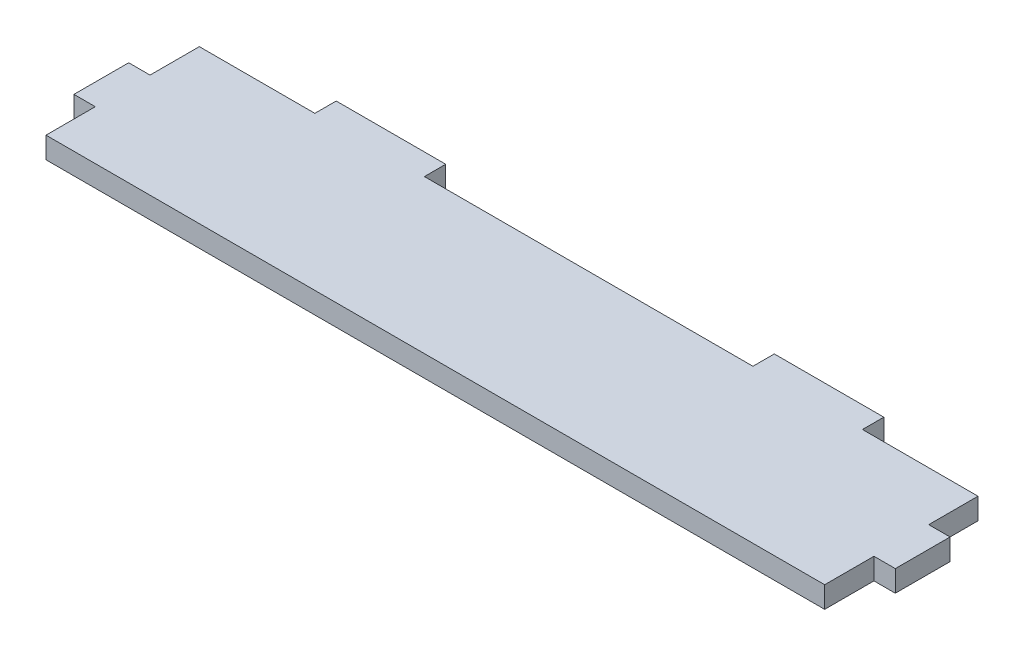
ISO-10303-21;
HEADER;
FILE_DESCRIPTION(('STEP AP214'),'2;1');
FILE_NAME('part.step','',(''),(''),'','','');
FILE_SCHEMA(('AUTOMOTIVE_DESIGN { 1 0 10303 214 1 1 1 1 }'));
ENDSEC;
DATA;
#1=APPLICATION_CONTEXT('core data for automotive mechanical design processes');
#2=APPLICATION_PROTOCOL_DEFINITION('international standard','automotive_design',2000,#1);
#3=PRODUCT_CONTEXT('',#1,'mechanical');
#4=PRODUCT('Part','Part','',(#3));
#5=PRODUCT_RELATED_PRODUCT_CATEGORY('part','',(#4));
#6=PRODUCT_DEFINITION_FORMATION('','',#4);
#7=PRODUCT_DEFINITION_CONTEXT('part definition',#1,'design');
#8=PRODUCT_DEFINITION('design','',#6,#7);
#9=PRODUCT_DEFINITION_SHAPE('','',#8);
#10=(LENGTH_UNIT() NAMED_UNIT(*) SI_UNIT(.MILLI.,.METRE.));
#11=(NAMED_UNIT(*) PLANE_ANGLE_UNIT() SI_UNIT($,.RADIAN.));
#12=(NAMED_UNIT(*) SI_UNIT($,.STERADIAN.) SOLID_ANGLE_UNIT());
#13=UNCERTAINTY_MEASURE_WITH_UNIT(LENGTH_MEASURE(1.E-05),#10,'distance_accuracy_value','');
#14=(GEOMETRIC_REPRESENTATION_CONTEXT(3) GLOBAL_UNCERTAINTY_ASSIGNED_CONTEXT((#13)) GLOBAL_UNIT_ASSIGNED_CONTEXT((#10,
#11,#12)) REPRESENTATION_CONTEXT('',''));
#15=CARTESIAN_POINT('',(0.,0.,0.));
#16=DIRECTION('',(0.,0.,1.));
#17=DIRECTION('',(1.,0.,0.));
#18=AXIS2_PLACEMENT_3D('',#15,#16,#17);
#19=CARTESIAN_POINT('',(71.1,3.9,4.99999999999998));
#20=DIRECTION('',(-1.,0.,0.));
#21=DIRECTION('',(0.,0.,1.));
#22=AXIS2_PLACEMENT_3D('',#19,#20,#21);
#23=PLANE('',#22);
#24=DIRECTION('',(0.,0.,-1.));
#25=VECTOR('',#24,1.);
#26=CARTESIAN_POINT('',(71.1,0.,4.99999999999998));
#27=LINE('',#26,#25);
#28=CARTESIAN_POINT('',(71.1,0.,14.));
#29=VERTEX_POINT('',#28);
#30=CARTESIAN_POINT('',(71.1,0.,4.99999999999998));
#31=VERTEX_POINT('',#30);
#32=EDGE_CURVE('E212',#29,#31,#27,.T.);
#33=ORIENTED_EDGE('',*,*,#32,.T.);
#34=DIRECTION('',(0.,-1.,0.));
#35=VECTOR('',#34,1.);
#36=CARTESIAN_POINT('',(71.1,3.9,4.99999999999998));
#37=LINE('',#36,#35);
#38=CARTESIAN_POINT('',(71.1,3.9,4.99999999999998));
#39=VERTEX_POINT('',#38);
#40=EDGE_CURVE('E11',#39,#31,#37,.T.);
#41=ORIENTED_EDGE('',*,*,#40,.F.);
#42=DIRECTION('',(0.,0.,-1.));
#43=VECTOR('',#42,1.);
#44=CARTESIAN_POINT('',(71.1,3.9,4.99999999999998));
#45=LINE('',#44,#43);
#46=CARTESIAN_POINT('',(71.1,3.9,14.));
#47=VERTEX_POINT('',#46);
#48=EDGE_CURVE('E270',#47,#39,#45,.T.);
#49=ORIENTED_EDGE('',*,*,#48,.F.);
#50=DIRECTION('',(0.,-1.,0.));
#51=VECTOR('',#50,1.);
#52=CARTESIAN_POINT('',(71.1,3.9,14.));
#53=LINE('',#52,#51);
#54=EDGE_CURVE('E208',#47,#29,#53,.T.);
#55=ORIENTED_EDGE('',*,*,#54,.T.);
#56=EDGE_LOOP('',(#33,#41,#49,#55));
#57=FACE_BOUND('',#56,.T.);
#58=ADVANCED_FACE('F39',(#57),#23,.F.);
#59=CARTESIAN_POINT('',(75.,3.9,4.99999999999998));
#60=DIRECTION('',(0.,0.,-1.));
#61=DIRECTION('',(-1.,0.,0.));
#62=AXIS2_PLACEMENT_3D('',#59,#60,#61);
#63=PLANE('',#62);
#64=DIRECTION('',(1.,0.,0.));
#65=VECTOR('',#64,1.);
#66=CARTESIAN_POINT('',(75.,0.,4.99999999999998));
#67=LINE('',#66,#65);
#68=CARTESIAN_POINT('',(75.,0.,4.99999999999998));
#69=VERTEX_POINT('',#68);
#70=EDGE_CURVE('E216',#31,#69,#67,.T.);
#71=ORIENTED_EDGE('',*,*,#70,.T.);
#72=DIRECTION('',(0.,-1.,0.));
#73=VECTOR('',#72,1.);
#74=CARTESIAN_POINT('',(75.,3.9,4.99999999999998));
#75=LINE('',#74,#73);
#76=CARTESIAN_POINT('',(75.,3.9,4.99999999999998));
#77=VERTEX_POINT('',#76);
#78=EDGE_CURVE('E48',#77,#69,#75,.T.);
#79=ORIENTED_EDGE('',*,*,#78,.F.);
#80=DIRECTION('',(1.,0.,0.));
#81=VECTOR('',#80,1.);
#82=CARTESIAN_POINT('',(75.,3.9,4.99999999999998));
#83=LINE('',#82,#81);
#84=EDGE_CURVE('E135',#39,#77,#83,.T.);
#85=ORIENTED_EDGE('',*,*,#84,.F.);
#86=ORIENTED_EDGE('',*,*,#40,.T.);
#87=EDGE_LOOP('',(#71,#79,#85,#86));
#88=FACE_BOUND('',#87,.T.);
#89=ADVANCED_FACE('F420',(#88),#63,.F.);
#90=CARTESIAN_POINT('',(75.,3.9,-5.00000000000002));
#91=DIRECTION('',(-1.,0.,0.));
#92=DIRECTION('',(0.,0.,1.));
#93=AXIS2_PLACEMENT_3D('',#90,#91,#92);
#94=PLANE('',#93);
#95=DIRECTION('',(0.,0.,-1.));
#96=VECTOR('',#95,1.);
#97=CARTESIAN_POINT('',(75.,0.,-5.00000000000002));
#98=LINE('',#97,#96);
#99=CARTESIAN_POINT('',(75.,0.,-5.00000000000002));
#100=VERTEX_POINT('',#99);
#101=EDGE_CURVE('E219',#69,#100,#98,.T.);
#102=ORIENTED_EDGE('',*,*,#101,.T.);
#103=DIRECTION('',(0.,-1.,0.));
#104=VECTOR('',#103,1.);
#105=CARTESIAN_POINT('',(75.,3.9,-5.00000000000002));
#106=LINE('',#105,#104);
#107=CARTESIAN_POINT('',(75.,3.9,-5.00000000000002));
#108=VERTEX_POINT('',#107);
#109=EDGE_CURVE('E329',#108,#100,#106,.T.);
#110=ORIENTED_EDGE('',*,*,#109,.F.);
#111=DIRECTION('',(0.,0.,-1.));
#112=VECTOR('',#111,1.);
#113=CARTESIAN_POINT('',(75.,3.9,-5.00000000000002));
#114=LINE('',#113,#112);
#115=EDGE_CURVE('E339',#77,#108,#114,.T.);
#116=ORIENTED_EDGE('',*,*,#115,.F.);
#117=ORIENTED_EDGE('',*,*,#78,.T.);
#118=EDGE_LOOP('',(#102,#110,#116,#117));
#119=FACE_BOUND('',#118,.T.);
#120=ADVANCED_FACE('F337',(#119),#94,.F.);
#121=CARTESIAN_POINT('',(75.,3.9,-5.00000000000002));
#122=DIRECTION('',(0.,0.,1.));
#123=DIRECTION('',(1.,0.,0.));
#124=AXIS2_PLACEMENT_3D('',#121,#122,#123);
#125=PLANE('',#124);
#126=DIRECTION('',(-1.,0.,0.));
#127=VECTOR('',#126,1.);
#128=CARTESIAN_POINT('',(75.,0.,-5.00000000000002));
#129=LINE('',#128,#127);
#130=CARTESIAN_POINT('',(71.1,0.,-5.00000000000002));
#131=VERTEX_POINT('',#130);
#132=EDGE_CURVE('E222',#100,#131,#129,.T.);
#133=ORIENTED_EDGE('',*,*,#132,.T.);
#134=DIRECTION('',(0.,-1.,0.));
#135=VECTOR('',#134,1.);
#136=CARTESIAN_POINT('',(71.1,3.9,-5.00000000000002));
#137=LINE('',#136,#135);
#138=CARTESIAN_POINT('',(71.1,3.9,-5.00000000000002));
#139=VERTEX_POINT('',#138);
#140=EDGE_CURVE('E325',#139,#131,#137,.T.);
#141=ORIENTED_EDGE('',*,*,#140,.F.);
#142=DIRECTION('',(-1.,0.,0.));
#143=VECTOR('',#142,1.);
#144=CARTESIAN_POINT('',(75.,3.9,-5.00000000000002));
#145=LINE('',#144,#143);
#146=EDGE_CURVE('E358',#108,#139,#145,.T.);
#147=ORIENTED_EDGE('',*,*,#146,.F.);
#148=ORIENTED_EDGE('',*,*,#109,.T.);
#149=EDGE_LOOP('',(#133,#141,#147,#148));
#150=FACE_BOUND('',#149,.T.);
#151=ADVANCED_FACE('F348',(#150),#125,.F.);
#152=CARTESIAN_POINT('',(71.1,3.9,-14.));
#153=DIRECTION('',(-1.,0.,0.));
#154=DIRECTION('',(0.,0.,1.));
#155=AXIS2_PLACEMENT_3D('',#152,#153,#154);
#156=PLANE('',#155);
#157=DIRECTION('',(0.,0.,-1.));
#158=VECTOR('',#157,1.);
#159=CARTESIAN_POINT('',(71.1,0.,-14.));
#160=LINE('',#159,#158);
#161=CARTESIAN_POINT('',(71.1,0.,-14.));
#162=VERTEX_POINT('',#161);
#163=EDGE_CURVE('E225',#131,#162,#160,.T.);
#164=ORIENTED_EDGE('',*,*,#163,.T.);
#165=DIRECTION('',(0.,-1.,0.));
#166=VECTOR('',#165,1.);
#167=CARTESIAN_POINT('',(71.1,3.9,-14.));
#168=LINE('',#167,#166);
#169=CARTESIAN_POINT('',(71.1,3.9,-14.));
#170=VERTEX_POINT('',#169);
#171=EDGE_CURVE('E321',#170,#162,#168,.T.);
#172=ORIENTED_EDGE('',*,*,#171,.F.);
#173=DIRECTION('',(0.,0.,-1.));
#174=VECTOR('',#173,1.);
#175=CARTESIAN_POINT('',(71.1,3.9,-14.));
#176=LINE('',#175,#174);
#177=EDGE_CURVE('E354',#139,#170,#176,.T.);
#178=ORIENTED_EDGE('',*,*,#177,.F.);
#179=ORIENTED_EDGE('',*,*,#140,.T.);
#180=EDGE_LOOP('',(#164,#172,#178,#179));
#181=FACE_BOUND('',#180,.T.);
#182=ADVANCED_FACE('F352',(#181),#156,.F.);
#183=CARTESIAN_POINT('',(50.,3.9,-14.));
#184=DIRECTION('',(0.,0.,1.));
#185=DIRECTION('',(1.,0.,0.));
#186=AXIS2_PLACEMENT_3D('',#183,#184,#185);
#187=PLANE('',#186);
#188=DIRECTION('',(-1.,0.,0.));
#189=VECTOR('',#188,1.);
#190=CARTESIAN_POINT('',(50.,0.,-14.));
#191=LINE('',#190,#189);
#192=CARTESIAN_POINT('',(50.,0.,-14.));
#193=VERTEX_POINT('',#192);
#194=EDGE_CURVE('E228',#162,#193,#191,.T.);
#195=ORIENTED_EDGE('',*,*,#194,.T.);
#196=DIRECTION('',(0.,-1.,0.));
#197=VECTOR('',#196,1.);
#198=CARTESIAN_POINT('',(50.,3.9,-14.));
#199=LINE('',#198,#197);
#200=CARTESIAN_POINT('',(50.,3.9,-14.));
#201=VERTEX_POINT('',#200);
#202=EDGE_CURVE('E317',#201,#193,#199,.T.);
#203=ORIENTED_EDGE('',*,*,#202,.F.);
#204=DIRECTION('',(-1.,0.,0.));
#205=VECTOR('',#204,1.);
#206=CARTESIAN_POINT('',(50.,3.9,-14.));
#207=LINE('',#206,#205);
#208=EDGE_CURVE('E357',#170,#201,#207,.T.);
#209=ORIENTED_EDGE('',*,*,#208,.F.);
#210=ORIENTED_EDGE('',*,*,#171,.T.);
#211=EDGE_LOOP('',(#195,#203,#209,#210));
#212=FACE_BOUND('',#211,.T.);
#213=ADVANCED_FACE('F433',(#212),#187,.F.);
#214=CARTESIAN_POINT('',(50.,3.9,-14.));
#215=DIRECTION('',(-1.,0.,0.));
#216=DIRECTION('',(0.,0.,1.));
#217=AXIS2_PLACEMENT_3D('',#214,#215,#216);
#218=PLANE('',#217);
#219=DIRECTION('',(0.,0.,-1.));
#220=VECTOR('',#219,1.);
#221=CARTESIAN_POINT('',(50.,0.,-14.));
#222=LINE('',#221,#220);
#223=CARTESIAN_POINT('',(50.,0.,-17.9));
#224=VERTEX_POINT('',#223);
#225=EDGE_CURVE('E231',#193,#224,#222,.T.);
#226=ORIENTED_EDGE('',*,*,#225,.T.);
#227=DIRECTION('',(0.,-1.,0.));
#228=VECTOR('',#227,1.);
#229=CARTESIAN_POINT('',(50.,3.9,-17.9));
#230=LINE('',#229,#228);
#231=CARTESIAN_POINT('',(50.,3.9,-17.9));
#232=VERTEX_POINT('',#231);
#233=EDGE_CURVE('E313',#232,#224,#230,.T.);
#234=ORIENTED_EDGE('',*,*,#233,.F.);
#235=DIRECTION('',(0.,0.,-1.));
#236=VECTOR('',#235,1.);
#237=CARTESIAN_POINT('',(50.,3.9,-14.));
#238=LINE('',#237,#236);
#239=EDGE_CURVE('E362',#201,#232,#238,.T.);
#240=ORIENTED_EDGE('',*,*,#239,.F.);
#241=ORIENTED_EDGE('',*,*,#202,.T.);
#242=EDGE_LOOP('',(#226,#234,#240,#241));
#243=FACE_BOUND('',#242,.T.);
#244=ADVANCED_FACE('F436',(#243),#218,.F.);
#245=CARTESIAN_POINT('',(50.,3.9,-17.9));
#246=DIRECTION('',(0.,0.,1.));
#247=DIRECTION('',(1.,0.,0.));
#248=AXIS2_PLACEMENT_3D('',#245,#246,#247);
#249=PLANE('',#248);
#250=DIRECTION('',(-1.,0.,0.));
#251=VECTOR('',#250,1.);
#252=CARTESIAN_POINT('',(50.,0.,-17.9));
#253=LINE('',#252,#251);
#254=CARTESIAN_POINT('',(30.,0.,-17.9));
#255=VERTEX_POINT('',#254);
#256=EDGE_CURVE('E234',#224,#255,#253,.T.);
#257=ORIENTED_EDGE('',*,*,#256,.T.);
#258=DIRECTION('',(0.,-1.,0.));
#259=VECTOR('',#258,1.);
#260=CARTESIAN_POINT('',(30.,3.9,-17.9));
#261=LINE('',#260,#259);
#262=CARTESIAN_POINT('',(30.,3.9,-17.9));
#263=VERTEX_POINT('',#262);
#264=EDGE_CURVE('E309',#263,#255,#261,.T.);
#265=ORIENTED_EDGE('',*,*,#264,.F.);
#266=DIRECTION('',(-1.,0.,0.));
#267=VECTOR('',#266,1.);
#268=CARTESIAN_POINT('',(50.,3.9,-17.9));
#269=LINE('',#268,#267);
#270=EDGE_CURVE('E369',#232,#263,#269,.T.);
#271=ORIENTED_EDGE('',*,*,#270,.F.);
#272=ORIENTED_EDGE('',*,*,#233,.T.);
#273=EDGE_LOOP('',(#257,#265,#271,#272));
#274=FACE_BOUND('',#273,.T.);
#275=ADVANCED_FACE('F440',(#274),#249,.F.);
#276=CARTESIAN_POINT('',(30.,3.9,-14.));
#277=DIRECTION('',(1.,0.,0.));
#278=DIRECTION('',(0.,0.,-1.));
#279=AXIS2_PLACEMENT_3D('',#276,#277,#278);
#280=PLANE('',#279);
#281=DIRECTION('',(0.,0.,1.));
#282=VECTOR('',#281,1.);
#283=CARTESIAN_POINT('',(30.,0.,-14.));
#284=LINE('',#283,#282);
#285=CARTESIAN_POINT('',(30.,0.,-14.));
#286=VERTEX_POINT('',#285);
#287=EDGE_CURVE('E237',#255,#286,#284,.T.);
#288=ORIENTED_EDGE('',*,*,#287,.T.);
#289=DIRECTION('',(0.,-1.,0.));
#290=VECTOR('',#289,1.);
#291=CARTESIAN_POINT('',(30.,3.9,-14.));
#292=LINE('',#291,#290);
#293=CARTESIAN_POINT('',(30.,3.9,-14.));
#294=VERTEX_POINT('',#293);
#295=EDGE_CURVE('E305',#294,#286,#292,.T.);
#296=ORIENTED_EDGE('',*,*,#295,.F.);
#297=DIRECTION('',(0.,0.,1.));
#298=VECTOR('',#297,1.);
#299=CARTESIAN_POINT('',(30.,3.9,-14.));
#300=LINE('',#299,#298);
#301=EDGE_CURVE('E372',#263,#294,#300,.T.);
#302=ORIENTED_EDGE('',*,*,#301,.F.);
#303=ORIENTED_EDGE('',*,*,#264,.T.);
#304=EDGE_LOOP('',(#288,#296,#302,#303));
#305=FACE_BOUND('',#304,.T.);
#306=ADVANCED_FACE('F444',(#305),#280,.F.);
#307=CARTESIAN_POINT('',(-30.,3.9,-14.));
#308=DIRECTION('',(0.,0.,1.));
#309=DIRECTION('',(1.,0.,0.));
#310=AXIS2_PLACEMENT_3D('',#307,#308,#309);
#311=PLANE('',#310);
#312=DIRECTION('',(-1.,0.,0.));
#313=VECTOR('',#312,1.);
#314=CARTESIAN_POINT('',(-30.,0.,-14.));
#315=LINE('',#314,#313);
#316=CARTESIAN_POINT('',(-30.,0.,-14.));
#317=VERTEX_POINT('',#316);
#318=EDGE_CURVE('E240',#286,#317,#315,.T.);
#319=ORIENTED_EDGE('',*,*,#318,.T.);
#320=DIRECTION('',(0.,-1.,0.));
#321=VECTOR('',#320,1.);
#322=CARTESIAN_POINT('',(-30.,3.9,-14.));
#323=LINE('',#322,#321);
#324=CARTESIAN_POINT('',(-30.,3.9,-14.));
#325=VERTEX_POINT('',#324);
#326=EDGE_CURVE('E301',#325,#317,#323,.T.);
#327=ORIENTED_EDGE('',*,*,#326,.F.);
#328=DIRECTION('',(-1.,0.,0.));
#329=VECTOR('',#328,1.);
#330=CARTESIAN_POINT('',(-30.,3.9,-14.));
#331=LINE('',#330,#329);
#332=EDGE_CURVE('E375',#294,#325,#331,.T.);
#333=ORIENTED_EDGE('',*,*,#332,.F.);
#334=ORIENTED_EDGE('',*,*,#295,.T.);
#335=EDGE_LOOP('',(#319,#327,#333,#334));
#336=FACE_BOUND('',#335,.T.);
#337=ADVANCED_FACE('F448',(#336),#311,.F.);
#338=CARTESIAN_POINT('',(-30.,3.9,-14.));
#339=DIRECTION('',(-1.,0.,0.));
#340=DIRECTION('',(0.,0.,1.));
#341=AXIS2_PLACEMENT_3D('',#338,#339,#340);
#342=PLANE('',#341);
#343=DIRECTION('',(0.,0.,-1.));
#344=VECTOR('',#343,1.);
#345=CARTESIAN_POINT('',(-30.,0.,-14.));
#346=LINE('',#345,#344);
#347=CARTESIAN_POINT('',(-30.,0.,-17.9));
#348=VERTEX_POINT('',#347);
#349=EDGE_CURVE('E243',#317,#348,#346,.T.);
#350=ORIENTED_EDGE('',*,*,#349,.T.);
#351=DIRECTION('',(0.,-1.,0.));
#352=VECTOR('',#351,1.);
#353=CARTESIAN_POINT('',(-30.,3.9,-17.9));
#354=LINE('',#353,#352);
#355=CARTESIAN_POINT('',(-30.,3.9,-17.9));
#356=VERTEX_POINT('',#355);
#357=EDGE_CURVE('E297',#356,#348,#354,.T.);
#358=ORIENTED_EDGE('',*,*,#357,.F.);
#359=DIRECTION('',(0.,0.,-1.));
#360=VECTOR('',#359,1.);
#361=CARTESIAN_POINT('',(-30.,3.9,-14.));
#362=LINE('',#361,#360);
#363=EDGE_CURVE('E378',#325,#356,#362,.T.);
#364=ORIENTED_EDGE('',*,*,#363,.F.);
#365=ORIENTED_EDGE('',*,*,#326,.T.);
#366=EDGE_LOOP('',(#350,#358,#364,#365));
#367=FACE_BOUND('',#366,.T.);
#368=ADVANCED_FACE('F452',(#367),#342,.F.);
#369=CARTESIAN_POINT('',(-50.,3.9,-17.9));
#370=DIRECTION('',(0.,0.,1.));
#371=DIRECTION('',(1.,0.,0.));
#372=AXIS2_PLACEMENT_3D('',#369,#370,#371);
#373=PLANE('',#372);
#374=DIRECTION('',(-1.,0.,0.));
#375=VECTOR('',#374,1.);
#376=CARTESIAN_POINT('',(-50.,0.,-17.9));
#377=LINE('',#376,#375);
#378=CARTESIAN_POINT('',(-50.,0.,-17.9));
#379=VERTEX_POINT('',#378);
#380=EDGE_CURVE('E246',#348,#379,#377,.T.);
#381=ORIENTED_EDGE('',*,*,#380,.T.);
#382=DIRECTION('',(0.,-1.,0.));
#383=VECTOR('',#382,1.);
#384=CARTESIAN_POINT('',(-50.,3.9,-17.9));
#385=LINE('',#384,#383);
#386=CARTESIAN_POINT('',(-50.,3.9,-17.9));
#387=VERTEX_POINT('',#386);
#388=EDGE_CURVE('E293',#387,#379,#385,.T.);
#389=ORIENTED_EDGE('',*,*,#388,.F.);
#390=DIRECTION('',(-1.,0.,0.));
#391=VECTOR('',#390,1.);
#392=CARTESIAN_POINT('',(-50.,3.9,-17.9));
#393=LINE('',#392,#391);
#394=EDGE_CURVE('E381',#356,#387,#393,.T.);
#395=ORIENTED_EDGE('',*,*,#394,.F.);
#396=ORIENTED_EDGE('',*,*,#357,.T.);
#397=EDGE_LOOP('',(#381,#389,#395,#396));
#398=FACE_BOUND('',#397,.T.);
#399=ADVANCED_FACE('F456',(#398),#373,.F.);
#400=CARTESIAN_POINT('',(-50.,3.9,-14.));
#401=DIRECTION('',(1.,0.,0.));
#402=DIRECTION('',(0.,0.,-1.));
#403=AXIS2_PLACEMENT_3D('',#400,#401,#402);
#404=PLANE('',#403);
#405=DIRECTION('',(0.,0.,1.));
#406=VECTOR('',#405,1.);
#407=CARTESIAN_POINT('',(-50.,0.,-14.));
#408=LINE('',#407,#406);
#409=CARTESIAN_POINT('',(-50.,0.,-14.));
#410=VERTEX_POINT('',#409);
#411=EDGE_CURVE('E249',#379,#410,#408,.T.);
#412=ORIENTED_EDGE('',*,*,#411,.T.);
#413=DIRECTION('',(0.,-1.,0.));
#414=VECTOR('',#413,1.);
#415=CARTESIAN_POINT('',(-50.,3.9,-14.));
#416=LINE('',#415,#414);
#417=CARTESIAN_POINT('',(-50.,3.9,-14.));
#418=VERTEX_POINT('',#417);
#419=EDGE_CURVE('E289',#418,#410,#416,.T.);
#420=ORIENTED_EDGE('',*,*,#419,.F.);
#421=DIRECTION('',(0.,0.,1.));
#422=VECTOR('',#421,1.);
#423=CARTESIAN_POINT('',(-50.,3.9,-14.));
#424=LINE('',#423,#422);
#425=EDGE_CURVE('E384',#387,#418,#424,.T.);
#426=ORIENTED_EDGE('',*,*,#425,.F.);
#427=ORIENTED_EDGE('',*,*,#388,.T.);
#428=EDGE_LOOP('',(#412,#420,#426,#427));
#429=FACE_BOUND('',#428,.T.);
#430=ADVANCED_FACE('F460',(#429),#404,.F.);
#431=CARTESIAN_POINT('',(-71.1,3.9,-14.));
#432=DIRECTION('',(0.,0.,1.));
#433=DIRECTION('',(1.,0.,0.));
#434=AXIS2_PLACEMENT_3D('',#431,#432,#433);
#435=PLANE('',#434);
#436=DIRECTION('',(-1.,0.,0.));
#437=VECTOR('',#436,1.);
#438=CARTESIAN_POINT('',(-71.1,0.,-14.));
#439=LINE('',#438,#437);
#440=CARTESIAN_POINT('',(-71.1,0.,-14.));
#441=VERTEX_POINT('',#440);
#442=EDGE_CURVE('E252',#410,#441,#439,.T.);
#443=ORIENTED_EDGE('',*,*,#442,.T.);
#444=DIRECTION('',(0.,-1.,0.));
#445=VECTOR('',#444,1.);
#446=CARTESIAN_POINT('',(-71.1,3.9,-14.));
#447=LINE('',#446,#445);
#448=CARTESIAN_POINT('',(-71.1,3.9,-14.));
#449=VERTEX_POINT('',#448);
#450=EDGE_CURVE('E285',#449,#441,#447,.T.);
#451=ORIENTED_EDGE('',*,*,#450,.F.);
#452=DIRECTION('',(-1.,0.,0.));
#453=VECTOR('',#452,1.);
#454=CARTESIAN_POINT('',(-71.1,3.9,-14.));
#455=LINE('',#454,#453);
#456=EDGE_CURVE('E387',#418,#449,#455,.T.);
#457=ORIENTED_EDGE('',*,*,#456,.F.);
#458=ORIENTED_EDGE('',*,*,#419,.T.);
#459=EDGE_LOOP('',(#443,#451,#457,#458));
#460=FACE_BOUND('',#459,.T.);
#461=ADVANCED_FACE('F464',(#460),#435,.F.);
#462=CARTESIAN_POINT('',(-71.1,3.9,-14.));
#463=DIRECTION('',(1.,0.,0.));
#464=DIRECTION('',(0.,0.,-1.));
#465=AXIS2_PLACEMENT_3D('',#462,#463,#464);
#466=PLANE('',#465);
#467=DIRECTION('',(0.,0.,1.));
#468=VECTOR('',#467,1.);
#469=CARTESIAN_POINT('',(-71.1,0.,-14.));
#470=LINE('',#469,#468);
#471=CARTESIAN_POINT('',(-71.1,0.,-5.));
#472=VERTEX_POINT('',#471);
#473=EDGE_CURVE('E255',#441,#472,#470,.T.);
#474=ORIENTED_EDGE('',*,*,#473,.T.);
#475=DIRECTION('',(0.,-1.,0.));
#476=VECTOR('',#475,1.);
#477=CARTESIAN_POINT('',(-71.1,3.9,-5.));
#478=LINE('',#477,#476);
#479=CARTESIAN_POINT('',(-71.1,3.9,-5.));
#480=VERTEX_POINT('',#479);
#481=EDGE_CURVE('E281',#480,#472,#478,.T.);
#482=ORIENTED_EDGE('',*,*,#481,.F.);
#483=DIRECTION('',(0.,0.,1.));
#484=VECTOR('',#483,1.);
#485=CARTESIAN_POINT('',(-71.1,3.9,-14.));
#486=LINE('',#485,#484);
#487=EDGE_CURVE('E390',#449,#480,#486,.T.);
#488=ORIENTED_EDGE('',*,*,#487,.F.);
#489=ORIENTED_EDGE('',*,*,#450,.T.);
#490=EDGE_LOOP('',(#474,#482,#488,#489));
#491=FACE_BOUND('',#490,.T.);
#492=ADVANCED_FACE('F468',(#491),#466,.F.);
#493=CARTESIAN_POINT('',(-75.,3.9,-5.));
#494=DIRECTION('',(0.,0.,1.));
#495=DIRECTION('',(1.,0.,0.));
#496=AXIS2_PLACEMENT_3D('',#493,#494,#495);
#497=PLANE('',#496);
#498=DIRECTION('',(-1.,0.,0.));
#499=VECTOR('',#498,1.);
#500=CARTESIAN_POINT('',(-75.,0.,-5.));
#501=LINE('',#500,#499);
#502=CARTESIAN_POINT('',(-75.,0.,-5.));
#503=VERTEX_POINT('',#502);
#504=EDGE_CURVE('E258',#472,#503,#501,.T.);
#505=ORIENTED_EDGE('',*,*,#504,.T.);
#506=DIRECTION('',(0.,-1.,0.));
#507=VECTOR('',#506,1.);
#508=CARTESIAN_POINT('',(-75.,3.9,-5.));
#509=LINE('',#508,#507);
#510=CARTESIAN_POINT('',(-75.,3.9,-5.));
#511=VERTEX_POINT('',#510);
#512=EDGE_CURVE('E277',#511,#503,#509,.T.);
#513=ORIENTED_EDGE('',*,*,#512,.F.);
#514=DIRECTION('',(-1.,0.,0.));
#515=VECTOR('',#514,1.);
#516=CARTESIAN_POINT('',(-75.,3.9,-5.));
#517=LINE('',#516,#515);
#518=EDGE_CURVE('E393',#480,#511,#517,.T.);
#519=ORIENTED_EDGE('',*,*,#518,.F.);
#520=ORIENTED_EDGE('',*,*,#481,.T.);
#521=EDGE_LOOP('',(#505,#513,#519,#520));
#522=FACE_BOUND('',#521,.T.);
#523=ADVANCED_FACE('F401',(#522),#497,.F.);
#524=CARTESIAN_POINT('',(-75.,3.9,-5.));
#525=DIRECTION('',(1.,0.,0.));
#526=DIRECTION('',(0.,0.,-1.));
#527=AXIS2_PLACEMENT_3D('',#524,#525,#526);
#528=PLANE('',#527);
#529=DIRECTION('',(0.,0.,1.));
#530=VECTOR('',#529,1.);
#531=CARTESIAN_POINT('',(-75.,0.,-5.));
#532=LINE('',#531,#530);
#533=CARTESIAN_POINT('',(-75.,0.,5.));
#534=VERTEX_POINT('',#533);
#535=EDGE_CURVE('E261',#503,#534,#532,.T.);
#536=ORIENTED_EDGE('',*,*,#535,.T.);
#537=DIRECTION('',(0.,-1.,0.));
#538=VECTOR('',#537,1.);
#539=CARTESIAN_POINT('',(-75.,3.9,5.));
#540=LINE('',#539,#538);
#541=CARTESIAN_POINT('',(-75.,3.9,5.));
#542=VERTEX_POINT('',#541);
#543=EDGE_CURVE('E201',#542,#534,#540,.T.);
#544=ORIENTED_EDGE('',*,*,#543,.F.);
#545=DIRECTION('',(0.,0.,1.));
#546=VECTOR('',#545,1.);
#547=CARTESIAN_POINT('',(-75.,3.9,-5.));
#548=LINE('',#547,#546);
#549=EDGE_CURVE('E190',#511,#542,#548,.T.);
#550=ORIENTED_EDGE('',*,*,#549,.F.);
#551=ORIENTED_EDGE('',*,*,#512,.T.);
#552=EDGE_LOOP('',(#536,#544,#550,#551));
#553=FACE_BOUND('',#552,.T.);
#554=ADVANCED_FACE('F405',(#553),#528,.F.);
#555=CARTESIAN_POINT('',(-75.,3.9,5.));
#556=DIRECTION('',(0.,0.,-1.));
#557=DIRECTION('',(-1.,0.,0.));
#558=AXIS2_PLACEMENT_3D('',#555,#556,#557);
#559=PLANE('',#558);
#560=DIRECTION('',(1.,0.,0.));
#561=VECTOR('',#560,1.);
#562=CARTESIAN_POINT('',(-75.,0.,5.));
#563=LINE('',#562,#561);
#564=CARTESIAN_POINT('',(-71.1,0.,5.));
#565=VERTEX_POINT('',#564);
#566=EDGE_CURVE('E199',#534,#565,#563,.T.);
#567=ORIENTED_EDGE('',*,*,#566,.T.);
#568=DIRECTION('',(0.,-1.,0.));
#569=VECTOR('',#568,1.);
#570=CARTESIAN_POINT('',(-71.1,3.9,5.));
#571=LINE('',#570,#569);
#572=CARTESIAN_POINT('',(-71.1,3.9,5.));
#573=VERTEX_POINT('',#572);
#574=EDGE_CURVE('E196',#573,#565,#571,.T.);
#575=ORIENTED_EDGE('',*,*,#574,.F.);
#576=DIRECTION('',(1.,0.,0.));
#577=VECTOR('',#576,1.);
#578=CARTESIAN_POINT('',(-75.,3.9,5.));
#579=LINE('',#578,#577);
#580=EDGE_CURVE('E184',#542,#573,#579,.T.);
#581=ORIENTED_EDGE('',*,*,#580,.F.);
#582=ORIENTED_EDGE('',*,*,#543,.T.);
#583=EDGE_LOOP('',(#567,#575,#581,#582));
#584=FACE_BOUND('',#583,.T.);
#585=ADVANCED_FACE('F197',(#584),#559,.F.);
#586=CARTESIAN_POINT('',(-71.1,3.9,5.));
#587=DIRECTION('',(1.,0.,0.));
#588=DIRECTION('',(0.,0.,-1.));
#589=AXIS2_PLACEMENT_3D('',#586,#587,#588);
#590=PLANE('',#589);
#591=DIRECTION('',(0.,0.,1.));
#592=VECTOR('',#591,1.);
#593=CARTESIAN_POINT('',(-71.1,0.,5.));
#594=LINE('',#593,#592);
#595=CARTESIAN_POINT('',(-71.1,0.,14.));
#596=VERTEX_POINT('',#595);
#597=EDGE_CURVE('E121',#565,#596,#594,.T.);
#598=ORIENTED_EDGE('',*,*,#597,.T.);
#599=DIRECTION('',(0.,-1.,0.));
#600=VECTOR('',#599,1.);
#601=CARTESIAN_POINT('',(-71.1,3.9,14.));
#602=LINE('',#601,#600);
#603=CARTESIAN_POINT('',(-71.1,3.9,14.));
#604=VERTEX_POINT('',#603);
#605=EDGE_CURVE('E202',#604,#596,#602,.T.);
#606=ORIENTED_EDGE('',*,*,#605,.F.);
#607=DIRECTION('',(0.,0.,1.));
#608=VECTOR('',#607,1.);
#609=CARTESIAN_POINT('',(-71.1,3.9,5.));
#610=LINE('',#609,#608);
#611=EDGE_CURVE('E188',#573,#604,#610,.T.);
#612=ORIENTED_EDGE('',*,*,#611,.F.);
#613=ORIENTED_EDGE('',*,*,#574,.T.);
#614=EDGE_LOOP('',(#598,#606,#612,#613));
#615=FACE_BOUND('',#614,.T.);
#616=ADVANCED_FACE('F204',(#615),#590,.F.);
#617=CARTESIAN_POINT('',(-71.1,3.9,14.));
#618=DIRECTION('',(0.,0.,-1.));
#619=DIRECTION('',(-1.,0.,0.));
#620=AXIS2_PLACEMENT_3D('',#617,#618,#619);
#621=PLANE('',#620);
#622=DIRECTION('',(1.,0.,0.));
#623=VECTOR('',#622,1.);
#624=CARTESIAN_POINT('',(-71.1,0.,14.));
#625=LINE('',#624,#623);
#626=EDGE_CURVE('E127',#596,#29,#625,.T.);
#627=ORIENTED_EDGE('',*,*,#626,.T.);
#628=ORIENTED_EDGE('',*,*,#54,.F.);
#629=DIRECTION('',(1.,0.,0.));
#630=VECTOR('',#629,1.);
#631=CARTESIAN_POINT('',(-71.1,3.9,14.));
#632=LINE('',#631,#630);
#633=EDGE_CURVE('E56',#604,#47,#632,.T.);
#634=ORIENTED_EDGE('',*,*,#633,.F.);
#635=ORIENTED_EDGE('',*,*,#605,.T.);
#636=EDGE_LOOP('',(#627,#628,#634,#635));
#637=FACE_BOUND('',#636,.T.);
#638=ADVANCED_FACE('F409',(#637),#621,.F.);
#639=CARTESIAN_POINT('',(0.,3.9,0.));
#640=DIRECTION('',(0.,1.,0.));
#641=DIRECTION('',(0.,0.,1.));
#642=AXIS2_PLACEMENT_3D('',#639,#640,#641);
#643=PLANE('',#642);
#644=ORIENTED_EDGE('',*,*,#48,.T.);
#645=ORIENTED_EDGE('',*,*,#84,.T.);
#646=ORIENTED_EDGE('',*,*,#115,.T.);
#647=ORIENTED_EDGE('',*,*,#146,.T.);
#648=ORIENTED_EDGE('',*,*,#177,.T.);
#649=ORIENTED_EDGE('',*,*,#208,.T.);
#650=ORIENTED_EDGE('',*,*,#239,.T.);
#651=ORIENTED_EDGE('',*,*,#270,.T.);
#652=ORIENTED_EDGE('',*,*,#301,.T.);
#653=ORIENTED_EDGE('',*,*,#332,.T.);
#654=ORIENTED_EDGE('',*,*,#363,.T.);
#655=ORIENTED_EDGE('',*,*,#394,.T.);
#656=ORIENTED_EDGE('',*,*,#425,.T.);
#657=ORIENTED_EDGE('',*,*,#456,.T.);
#658=ORIENTED_EDGE('',*,*,#487,.T.);
#659=ORIENTED_EDGE('',*,*,#518,.T.);
#660=ORIENTED_EDGE('',*,*,#549,.T.);
#661=ORIENTED_EDGE('',*,*,#580,.T.);
#662=ORIENTED_EDGE('',*,*,#611,.T.);
#663=ORIENTED_EDGE('',*,*,#633,.T.);
#664=EDGE_LOOP('',(#644,#645,#646,#647,#648,#649,#650,#651,#652,#653,#654,#655,#656,#657,#658,
#659,#660,#661,#662,#663));
#665=FACE_BOUND('',#664,.T.);
#666=ADVANCED_FACE('F186',(#665),#643,.T.);
#667=CARTESIAN_POINT('',(0.,0.,0.));
#668=DIRECTION('',(0.,1.,0.));
#669=DIRECTION('',(0.,0.,1.));
#670=AXIS2_PLACEMENT_3D('',#667,#668,#669);
#671=PLANE('',#670);
#672=ORIENTED_EDGE('',*,*,#32,.F.);
#673=ORIENTED_EDGE('',*,*,#626,.F.);
#674=ORIENTED_EDGE('',*,*,#597,.F.);
#675=ORIENTED_EDGE('',*,*,#566,.F.);
#676=ORIENTED_EDGE('',*,*,#535,.F.);
#677=ORIENTED_EDGE('',*,*,#504,.F.);
#678=ORIENTED_EDGE('',*,*,#473,.F.);
#679=ORIENTED_EDGE('',*,*,#442,.F.);
#680=ORIENTED_EDGE('',*,*,#411,.F.);
#681=ORIENTED_EDGE('',*,*,#380,.F.);
#682=ORIENTED_EDGE('',*,*,#349,.F.);
#683=ORIENTED_EDGE('',*,*,#318,.F.);
#684=ORIENTED_EDGE('',*,*,#287,.F.);
#685=ORIENTED_EDGE('',*,*,#256,.F.);
#686=ORIENTED_EDGE('',*,*,#225,.F.);
#687=ORIENTED_EDGE('',*,*,#194,.F.);
#688=ORIENTED_EDGE('',*,*,#163,.F.);
#689=ORIENTED_EDGE('',*,*,#132,.F.);
#690=ORIENTED_EDGE('',*,*,#101,.F.);
#691=ORIENTED_EDGE('',*,*,#70,.F.);
#692=EDGE_LOOP('',(#672,#673,#674,#675,#676,#677,#678,#679,#680,#681,#682,#683,#684,#685,#686,
#687,#688,#689,#690,#691));
#693=FACE_BOUND('',#692,.T.);
#694=ADVANCED_FACE('F343',(#693),#671,.F.);
#695=CLOSED_SHELL('',(#58,#89,#120,#151,#182,#213,#244,#275,#306,#337,#368,#399,#430,#461,#492,
#523,#554,#585,#616,#638,#666,#694));
#696=MANIFOLD_SOLID_BREP('B2',#695);
#697=ADVANCED_BREP_SHAPE_REPRESENTATION('',(#18,#696),#14);
#698=SHAPE_DEFINITION_REPRESENTATION(#9,#697);
ENDSEC;
END-ISO-10303-21;
